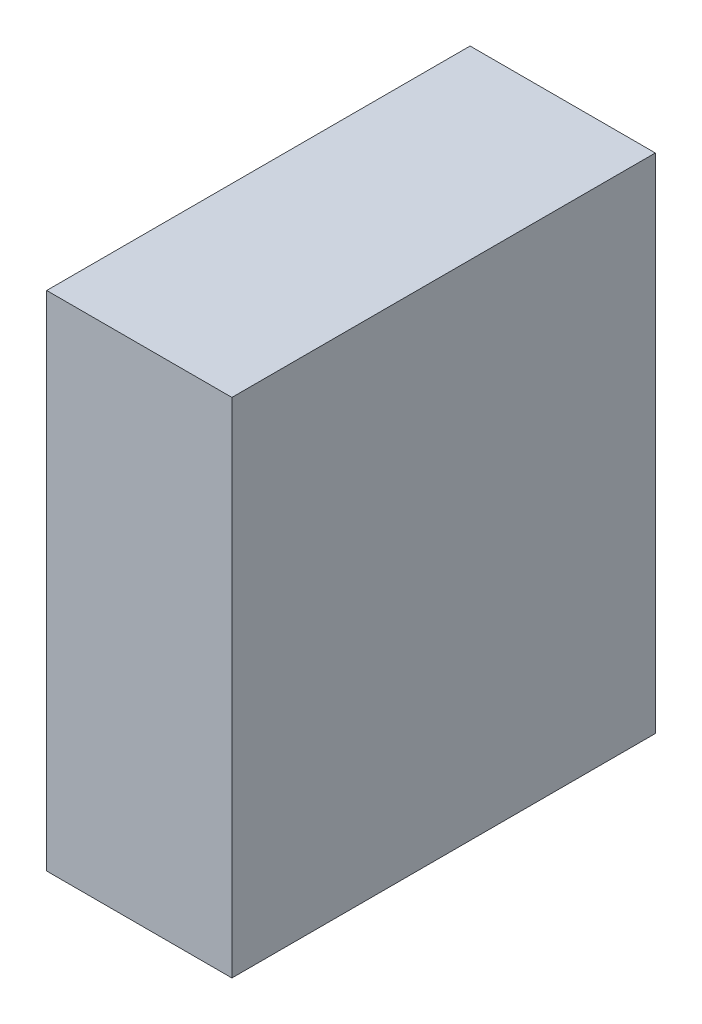
ISO-10303-21;
HEADER;
FILE_DESCRIPTION(('STEP AP214'),'2;1');
FILE_NAME('part.step','',(''),(''),'','','');
FILE_SCHEMA(('AUTOMOTIVE_DESIGN { 1 0 10303 214 1 1 1 1 }'));
ENDSEC;
DATA;
#1=APPLICATION_CONTEXT('core data for automotive mechanical design processes');
#2=APPLICATION_PROTOCOL_DEFINITION('international standard','automotive_design',2000,#1);
#3=PRODUCT_CONTEXT('',#1,'mechanical');
#4=PRODUCT('Part','Part','',(#3));
#5=PRODUCT_RELATED_PRODUCT_CATEGORY('part','',(#4));
#6=PRODUCT_DEFINITION_FORMATION('','',#4);
#7=PRODUCT_DEFINITION_CONTEXT('part definition',#1,'design');
#8=PRODUCT_DEFINITION('design','',#6,#7);
#9=PRODUCT_DEFINITION_SHAPE('','',#8);
#10=(LENGTH_UNIT() NAMED_UNIT(*) SI_UNIT(.MILLI.,.METRE.));
#11=(NAMED_UNIT(*) PLANE_ANGLE_UNIT() SI_UNIT($,.RADIAN.));
#12=(NAMED_UNIT(*) SI_UNIT($,.STERADIAN.) SOLID_ANGLE_UNIT());
#13=UNCERTAINTY_MEASURE_WITH_UNIT(LENGTH_MEASURE(1.E-05),#10,'distance_accuracy_value','');
#14=(GEOMETRIC_REPRESENTATION_CONTEXT(3) GLOBAL_UNCERTAINTY_ASSIGNED_CONTEXT((#13)) GLOBAL_UNIT_ASSIGNED_CONTEXT((#10,
#11,#12)) REPRESENTATION_CONTEXT('',''));
#15=CARTESIAN_POINT('',(0.,0.,0.));
#16=DIRECTION('',(0.,0.,1.));
#17=DIRECTION('',(1.,0.,0.));
#18=AXIS2_PLACEMENT_3D('',#15,#16,#17);
#19=CARTESIAN_POINT('',(-0.17500092,0.47500032,0.));
#20=DIRECTION('',(1.,0.,0.));
#21=DIRECTION('',(0.,0.,-1.));
#22=AXIS2_PLACEMENT_3D('',#19,#20,#21);
#23=PLANE('',#22);
#24=DIRECTION('',(0.,0.,1.));
#25=VECTOR('',#24,1.);
#26=CARTESIAN_POINT('',(-0.17500092,-0.47500032,0.));
#27=LINE('',#26,#25);
#28=CARTESIAN_POINT('',(-0.17500092,-0.47500032,0.));
#29=VERTEX_POINT('',#28);
#30=CARTESIAN_POINT('',(-0.17500092,-0.47500032,0.80000094));
#31=VERTEX_POINT('',#30);
#32=EDGE_CURVE('E19',#29,#31,#27,.T.);
#33=ORIENTED_EDGE('',*,*,#32,.T.);
#34=DIRECTION('',(0.,1.,0.));
#35=VECTOR('',#34,1.);
#36=CARTESIAN_POINT('',(-0.17500092,-0.47500032,0.80000094));
#37=LINE('',#36,#35);
#38=CARTESIAN_POINT('',(-0.17500092,0.47500032,0.80000094));
#39=VERTEX_POINT('',#38);
#40=EDGE_CURVE('E54',#31,#39,#37,.T.);
#41=ORIENTED_EDGE('',*,*,#40,.T.);
#42=DIRECTION('',(0.,0.,-1.));
#43=VECTOR('',#42,1.);
#44=CARTESIAN_POINT('',(-0.17500092,0.47500032,0.));
#45=LINE('',#44,#43);
#46=CARTESIAN_POINT('',(-0.17500092,0.47500032,0.));
#47=VERTEX_POINT('',#46);
#48=EDGE_CURVE('E75',#39,#47,#45,.T.);
#49=ORIENTED_EDGE('',*,*,#48,.T.);
#50=DIRECTION('',(0.,1.,0.));
#51=VECTOR('',#50,1.);
#52=CARTESIAN_POINT('',(-0.17500092,-0.47500032,0.));
#53=LINE('',#52,#51);
#54=EDGE_CURVE('E57',#29,#47,#53,.T.);
#55=ORIENTED_EDGE('',*,*,#54,.F.);
#56=EDGE_LOOP('',(#33,#41,#49,#55));
#57=FACE_BOUND('',#56,.T.);
#58=ADVANCED_FACE('F16',(#57),#23,.F.);
#59=CARTESIAN_POINT('',(-0.17500092,-0.47500032,0.));
#60=DIRECTION('',(0.,1.,0.));
#61=DIRECTION('',(0.,0.,1.));
#62=AXIS2_PLACEMENT_3D('',#59,#60,#61);
#63=PLANE('',#62);
#64=DIRECTION('',(0.,0.,1.));
#65=VECTOR('',#64,1.);
#66=CARTESIAN_POINT('',(0.17500092,-0.47500032,0.));
#67=LINE('',#66,#65);
#68=CARTESIAN_POINT('',(0.17500092,-0.47500032,0.));
#69=VERTEX_POINT('',#68);
#70=CARTESIAN_POINT('',(0.17500092,-0.47500032,0.80000094));
#71=VERTEX_POINT('',#70);
#72=EDGE_CURVE('E72',#69,#71,#67,.T.);
#73=ORIENTED_EDGE('',*,*,#72,.T.);
#74=DIRECTION('',(-1.,0.,0.));
#75=VECTOR('',#74,1.);
#76=CARTESIAN_POINT('',(0.17500092,-0.47500032,0.80000094));
#77=LINE('',#76,#75);
#78=EDGE_CURVE('E62',#71,#31,#77,.T.);
#79=ORIENTED_EDGE('',*,*,#78,.T.);
#80=ORIENTED_EDGE('',*,*,#32,.F.);
#81=DIRECTION('',(-1.,0.,0.));
#82=VECTOR('',#81,1.);
#83=CARTESIAN_POINT('',(0.17500092,-0.47500032,0.));
#84=LINE('',#83,#82);
#85=EDGE_CURVE('E77',#69,#29,#84,.T.);
#86=ORIENTED_EDGE('',*,*,#85,.F.);
#87=EDGE_LOOP('',(#73,#79,#80,#86));
#88=FACE_BOUND('',#87,.T.);
#89=ADVANCED_FACE('F71',(#88),#63,.F.);
#90=CARTESIAN_POINT('',(0.17500092,-0.47500032,0.80000094));
#91=DIRECTION('',(0.,0.,-1.));
#92=DIRECTION('',(-1.,0.,0.));
#93=AXIS2_PLACEMENT_3D('',#90,#91,#92);
#94=PLANE('',#93);
#95=DIRECTION('',(1.,0.,0.));
#96=VECTOR('',#95,1.);
#97=CARTESIAN_POINT('',(0.17500092,0.47500032,0.80000094));
#98=LINE('',#97,#96);
#99=CARTESIAN_POINT('',(0.17500092,0.47500032,0.80000094));
#100=VERTEX_POINT('',#99);
#101=EDGE_CURVE('E68',#100,#39,#98,.F.);
#102=ORIENTED_EDGE('',*,*,#101,.T.);
#103=ORIENTED_EDGE('',*,*,#40,.F.);
#104=ORIENTED_EDGE('',*,*,#78,.F.);
#105=DIRECTION('',(0.,1.,0.));
#106=VECTOR('',#105,1.);
#107=CARTESIAN_POINT('',(0.17500092,-0.47500032,0.80000094));
#108=LINE('',#107,#106);
#109=EDGE_CURVE('E82',#71,#100,#108,.T.);
#110=ORIENTED_EDGE('',*,*,#109,.T.);
#111=EDGE_LOOP('',(#102,#103,#104,#110));
#112=FACE_BOUND('',#111,.T.);
#113=ADVANCED_FACE('F65',(#112),#94,.F.);
#114=CARTESIAN_POINT('',(0.17500092,0.47500032,0.));
#115=DIRECTION('',(0.,-1.,0.));
#116=DIRECTION('',(0.,0.,-1.));
#117=AXIS2_PLACEMENT_3D('',#114,#115,#116);
#118=PLANE('',#117);
#119=ORIENTED_EDGE('',*,*,#48,.F.);
#120=ORIENTED_EDGE('',*,*,#101,.F.);
#121=DIRECTION('',(0.,0.,1.));
#122=VECTOR('',#121,1.);
#123=CARTESIAN_POINT('',(0.17500092,0.47500032,0.));
#124=LINE('',#123,#122);
#125=CARTESIAN_POINT('',(0.17500092,0.47500032,0.));
#126=VERTEX_POINT('',#125);
#127=EDGE_CURVE('E25',#100,#126,#124,.F.);
#128=ORIENTED_EDGE('',*,*,#127,.T.);
#129=DIRECTION('',(-1.,0.,0.));
#130=VECTOR('',#129,1.);
#131=CARTESIAN_POINT('',(0.17500092,0.47500032,0.));
#132=LINE('',#131,#130);
#133=EDGE_CURVE('E33',#47,#126,#132,.F.);
#134=ORIENTED_EDGE('',*,*,#133,.F.);
#135=EDGE_LOOP('',(#119,#120,#128,#134));
#136=FACE_BOUND('',#135,.T.);
#137=ADVANCED_FACE('F87',(#136),#118,.F.);
#138=CARTESIAN_POINT('',(0.17500092,-0.47500032,0.));
#139=DIRECTION('',(0.,0.,-1.));
#140=DIRECTION('',(-1.,0.,0.));
#141=AXIS2_PLACEMENT_3D('',#138,#139,#140);
#142=PLANE('',#141);
#143=ORIENTED_EDGE('',*,*,#133,.T.);
#144=DIRECTION('',(0.,1.,0.));
#145=VECTOR('',#144,1.);
#146=CARTESIAN_POINT('',(0.17500092,-0.47500032,0.));
#147=LINE('',#146,#145);
#148=EDGE_CURVE('E11',#126,#69,#147,.F.);
#149=ORIENTED_EDGE('',*,*,#148,.T.);
#150=ORIENTED_EDGE('',*,*,#85,.T.);
#151=ORIENTED_EDGE('',*,*,#54,.T.);
#152=EDGE_LOOP('',(#143,#149,#150,#151));
#153=FACE_BOUND('',#152,.T.);
#154=ADVANCED_FACE('F90',(#153),#142,.T.);
#155=CARTESIAN_POINT('',(0.17500092,-0.47500032,0.));
#156=DIRECTION('',(-1.,0.,0.));
#157=DIRECTION('',(0.,0.,1.));
#158=AXIS2_PLACEMENT_3D('',#155,#156,#157);
#159=PLANE('',#158);
#160=ORIENTED_EDGE('',*,*,#127,.F.);
#161=ORIENTED_EDGE('',*,*,#109,.F.);
#162=ORIENTED_EDGE('',*,*,#72,.F.);
#163=ORIENTED_EDGE('',*,*,#148,.F.);
#164=EDGE_LOOP('',(#160,#161,#162,#163));
#165=FACE_BOUND('',#164,.T.);
#166=ADVANCED_FACE('F89',(#165),#159,.F.);
#167=CLOSED_SHELL('',(#58,#89,#113,#137,#154,#166));
#168=MANIFOLD_SOLID_BREP('B1',#167);
#169=ADVANCED_BREP_SHAPE_REPRESENTATION('',(#18,#168),#14);
#170=SHAPE_DEFINITION_REPRESENTATION(#9,#169);
ENDSEC;
END-ISO-10303-21;
